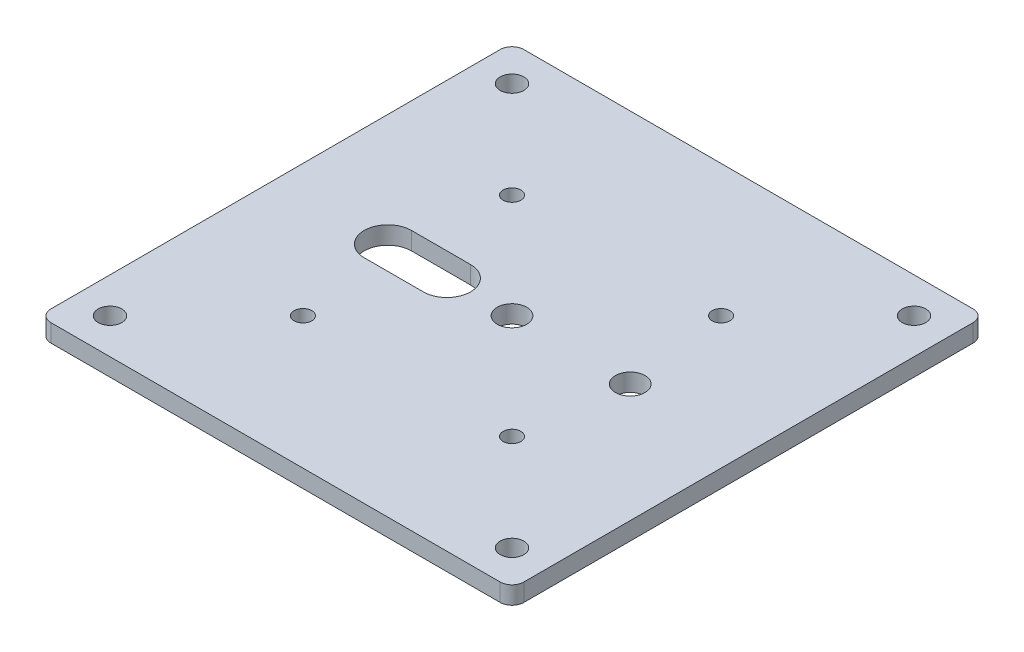
ISO-10303-21;
HEADER;
FILE_DESCRIPTION(('STEP AP214'),'2;1');
FILE_NAME('part.step','',(''),(''),'','','');
FILE_SCHEMA(('AUTOMOTIVE_DESIGN { 1 0 10303 214 1 1 1 1 }'));
ENDSEC;
DATA;
#1=APPLICATION_CONTEXT('core data for automotive mechanical design processes');
#2=APPLICATION_PROTOCOL_DEFINITION('international standard','automotive_design',2000,#1);
#3=PRODUCT_CONTEXT('',#1,'mechanical');
#4=PRODUCT('Part','Part','',(#3));
#5=PRODUCT_RELATED_PRODUCT_CATEGORY('part','',(#4));
#6=PRODUCT_DEFINITION_FORMATION('','',#4);
#7=PRODUCT_DEFINITION_CONTEXT('part definition',#1,'design');
#8=PRODUCT_DEFINITION('design','',#6,#7);
#9=PRODUCT_DEFINITION_SHAPE('','',#8);
#10=(LENGTH_UNIT() NAMED_UNIT(*) SI_UNIT(.MILLI.,.METRE.));
#11=(NAMED_UNIT(*) PLANE_ANGLE_UNIT() SI_UNIT($,.RADIAN.));
#12=(NAMED_UNIT(*) SI_UNIT($,.STERADIAN.) SOLID_ANGLE_UNIT());
#13=UNCERTAINTY_MEASURE_WITH_UNIT(LENGTH_MEASURE(1.E-05),#10,'distance_accuracy_value','');
#14=(GEOMETRIC_REPRESENTATION_CONTEXT(3) GLOBAL_UNCERTAINTY_ASSIGNED_CONTEXT((#13)) GLOBAL_UNIT_ASSIGNED_CONTEXT((#10,
#11,#12)) REPRESENTATION_CONTEXT('',''));
#15=CARTESIAN_POINT('',(0.,0.,0.));
#16=DIRECTION('',(0.,0.,1.));
#17=DIRECTION('',(1.,0.,0.));
#18=AXIS2_PLACEMENT_3D('',#15,#16,#17);
#19=CARTESIAN_POINT('',(0.,3.,-80.));
#20=DIRECTION('',(0.,-1.,0.));
#21=DIRECTION('',(0.,0.,-1.));
#22=AXIS2_PLACEMENT_3D('',#19,#20,#21);
#23=PLANE('',#22);
#24=CARTESIAN_POINT('',(74.,3.,-6.00000000000001));
#25=DIRECTION('',(0.,1.,0.));
#26=DIRECTION('',(0.,0.,1.));
#27=AXIS2_PLACEMENT_3D('',#24,#25,#26);
#28=CIRCLE('',#27,2.00000000000001);
#29=CARTESIAN_POINT('',(74.,3.,-3.99999999999999));
#30=VERTEX_POINT('',#29);
#31=EDGE_CURVE('E402',#30,#30,#28,.T.);
#32=ORIENTED_EDGE('',*,*,#31,.F.);
#33=EDGE_LOOP('',(#32));
#34=FACE_BOUND('',#33,.T.);
#35=CARTESIAN_POINT('',(6.00000000000001,3.,-74.));
#36=DIRECTION('',(0.,1.,0.));
#37=DIRECTION('',(0.,0.,1.));
#38=AXIS2_PLACEMENT_3D('',#35,#36,#37);
#39=CIRCLE('',#38,2.);
#40=CARTESIAN_POINT('',(6.00000000000001,3.,-72.));
#41=VERTEX_POINT('',#40);
#42=EDGE_CURVE('E157',#41,#41,#39,.T.);
#43=ORIENTED_EDGE('',*,*,#42,.F.);
#44=EDGE_LOOP('',(#43));
#45=FACE_BOUND('',#44,.T.);
#46=CARTESIAN_POINT('',(57.6776695296637,3.,-22.3223304703363));
#47=DIRECTION('',(0.,1.,0.));
#48=DIRECTION('',(0.,0.,-1.));
#49=AXIS2_PLACEMENT_3D('',#46,#47,#48);
#50=CIRCLE('',#49,1.5);
#51=CARTESIAN_POINT('',(57.6776695296637,3.,-23.8223304703363));
#52=VERTEX_POINT('',#51);
#53=EDGE_CURVE('E168',#52,#52,#50,.T.);
#54=ORIENTED_EDGE('',*,*,#53,.F.);
#55=EDGE_LOOP('',(#54));
#56=FACE_BOUND('',#55,.T.);
#57=CARTESIAN_POINT('',(22.3223304703363,3.,-22.3223304703363));
#58=DIRECTION('',(0.,1.,0.));
#59=DIRECTION('',(0.,0.,-1.));
#60=AXIS2_PLACEMENT_3D('',#57,#58,#59);
#61=CIRCLE('',#60,1.5);
#62=CARTESIAN_POINT('',(22.3223304703363,3.,-23.8223304703363));
#63=VERTEX_POINT('',#62);
#64=EDGE_CURVE('E180',#63,#63,#61,.T.);
#65=ORIENTED_EDGE('',*,*,#64,.F.);
#66=EDGE_LOOP('',(#65));
#67=FACE_BOUND('',#66,.T.);
#68=CARTESIAN_POINT('',(60.,3.,-40.));
#69=DIRECTION('',(0.,1.,0.));
#70=DIRECTION('',(0.,0.,1.));
#71=AXIS2_PLACEMENT_3D('',#68,#69,#70);
#72=CIRCLE('',#71,2.5);
#73=CARTESIAN_POINT('',(60.,3.,-37.5));
#74=VERTEX_POINT('',#73);
#75=EDGE_CURVE('E192',#74,#74,#72,.T.);
#76=ORIENTED_EDGE('',*,*,#75,.F.);
#77=EDGE_LOOP('',(#76));
#78=FACE_BOUND('',#77,.T.);
#79=DIRECTION('',(0.,0.,-1.));
#80=VECTOR('',#79,1.);
#81=CARTESIAN_POINT('',(80.,3.,0.));
#82=LINE('',#81,#80);
#83=CARTESIAN_POINT('',(80.,3.,-2.));
#84=VERTEX_POINT('',#83);
#85=CARTESIAN_POINT('',(80.,3.,-78.));
#86=VERTEX_POINT('',#85);
#87=EDGE_CURVE('E209',#84,#86,#82,.T.);
#88=ORIENTED_EDGE('',*,*,#87,.T.);
#89=CARTESIAN_POINT('',(78.,3.,-78.));
#90=DIRECTION('',(0.,-1.,0.));
#91=DIRECTION('',(0.,0.,-1.));
#92=AXIS2_PLACEMENT_3D('',#89,#90,#91);
#93=CIRCLE('',#92,2.);
#94=CARTESIAN_POINT('',(78.,3.,-80.));
#95=VERTEX_POINT('',#94);
#96=EDGE_CURVE('E247',#86,#95,#93,.F.);
#97=ORIENTED_EDGE('',*,*,#96,.T.);
#98=DIRECTION('',(-1.,0.,0.));
#99=VECTOR('',#98,1.);
#100=CARTESIAN_POINT('',(0.,3.,-80.));
#101=LINE('',#100,#99);
#102=CARTESIAN_POINT('',(2.,3.,-80.));
#103=VERTEX_POINT('',#102);
#104=EDGE_CURVE('E212',#95,#103,#101,.T.);
#105=ORIENTED_EDGE('',*,*,#104,.T.);
#106=CARTESIAN_POINT('',(2.,3.,-78.));
#107=DIRECTION('',(0.,-1.,0.));
#108=DIRECTION('',(0.,0.,-1.));
#109=AXIS2_PLACEMENT_3D('',#106,#107,#108);
#110=CIRCLE('',#109,2.);
#111=CARTESIAN_POINT('',(0.,3.,-78.));
#112=VERTEX_POINT('',#111);
#113=EDGE_CURVE('E243',#103,#112,#110,.F.);
#114=ORIENTED_EDGE('',*,*,#113,.T.);
#115=DIRECTION('',(0.,0.,1.));
#116=VECTOR('',#115,1.);
#117=CARTESIAN_POINT('',(0.,3.,0.));
#118=LINE('',#117,#116);
#119=CARTESIAN_POINT('',(0.,3.,-2.));
#120=VERTEX_POINT('',#119);
#121=EDGE_CURVE('E204',#112,#120,#118,.T.);
#122=ORIENTED_EDGE('',*,*,#121,.T.);
#123=CARTESIAN_POINT('',(2.,3.,-2.));
#124=DIRECTION('',(0.,-1.,0.));
#125=DIRECTION('',(0.,0.,-1.));
#126=AXIS2_PLACEMENT_3D('',#123,#124,#125);
#127=CIRCLE('',#126,2.);
#128=CARTESIAN_POINT('',(2.,3.,0.));
#129=VERTEX_POINT('',#128);
#130=EDGE_CURVE('E53',#120,#129,#127,.F.);
#131=ORIENTED_EDGE('',*,*,#130,.T.);
#132=DIRECTION('',(1.,0.,0.));
#133=VECTOR('',#132,1.);
#134=CARTESIAN_POINT('',(0.,3.,0.));
#135=LINE('',#134,#133);
#136=CARTESIAN_POINT('',(78.,3.,0.));
#137=VERTEX_POINT('',#136);
#138=EDGE_CURVE('E206',#129,#137,#135,.T.);
#139=ORIENTED_EDGE('',*,*,#138,.T.);
#140=CARTESIAN_POINT('',(78.,3.,-2.));
#141=DIRECTION('',(0.,-1.,0.));
#142=DIRECTION('',(0.,0.,-1.));
#143=AXIS2_PLACEMENT_3D('',#140,#141,#142);
#144=CIRCLE('',#143,2.);
#145=EDGE_CURVE('E245',#137,#84,#144,.F.);
#146=ORIENTED_EDGE('',*,*,#145,.T.);
#147=EDGE_LOOP('',(#88,#97,#105,#114,#122,#131,#139,#146));
#148=FACE_BOUND('',#147,.T.);
#149=CARTESIAN_POINT('',(40.,3.,-40.));
#150=DIRECTION('',(0.,1.,0.));
#151=DIRECTION('',(0.,0.,1.));
#152=AXIS2_PLACEMENT_3D('',#149,#150,#151);
#153=CIRCLE('',#152,2.5);
#154=CARTESIAN_POINT('',(40.,3.,-37.5));
#155=VERTEX_POINT('',#154);
#156=EDGE_CURVE('E198',#155,#155,#153,.T.);
#157=ORIENTED_EDGE('',*,*,#156,.F.);
#158=EDGE_LOOP('',(#157));
#159=FACE_BOUND('',#158,.T.);
#160=CARTESIAN_POINT('',(57.6776695296637,3.,-57.6776695296637));
#161=DIRECTION('',(0.,1.,0.));
#162=DIRECTION('',(0.,0.,1.));
#163=AXIS2_PLACEMENT_3D('',#160,#161,#162);
#164=CIRCLE('',#163,1.5);
#165=CARTESIAN_POINT('',(57.6776695296637,3.,-56.1776695296637));
#166=VERTEX_POINT('',#165);
#167=EDGE_CURVE('E186',#166,#166,#164,.T.);
#168=ORIENTED_EDGE('',*,*,#167,.F.);
#169=EDGE_LOOP('',(#168));
#170=FACE_BOUND('',#169,.T.);
#171=CARTESIAN_POINT('',(22.3223304703363,3.,-57.6776695296637));
#172=DIRECTION('',(0.,1.,0.));
#173=DIRECTION('',(0.,0.,1.));
#174=AXIS2_PLACEMENT_3D('',#171,#172,#173);
#175=CIRCLE('',#174,1.5);
#176=CARTESIAN_POINT('',(22.3223304703363,3.,-56.1776695296637));
#177=VERTEX_POINT('',#176);
#178=EDGE_CURVE('E174',#177,#177,#175,.T.);
#179=ORIENTED_EDGE('',*,*,#178,.F.);
#180=EDGE_LOOP('',(#179));
#181=FACE_BOUND('',#180,.T.);
#182=CARTESIAN_POINT('',(19.,3.,-40.));
#183=DIRECTION('',(0.,1.,0.));
#184=DIRECTION('',(0.,0.,1.));
#185=AXIS2_PLACEMENT_3D('',#182,#183,#184);
#186=CIRCLE('',#185,4.);
#187=CARTESIAN_POINT('',(19.,3.,-44.));
#188=VERTEX_POINT('',#187);
#189=CARTESIAN_POINT('',(19.,3.,-36.));
#190=VERTEX_POINT('',#189);
#191=EDGE_CURVE('E122',#188,#190,#186,.T.);
#192=ORIENTED_EDGE('',*,*,#191,.F.);
#193=DIRECTION('',(-1.,0.,0.));
#194=VECTOR('',#193,1.);
#195=CARTESIAN_POINT('',(19.,3.,-44.));
#196=LINE('',#195,#194);
#197=CARTESIAN_POINT('',(29.,3.,-44.));
#198=VERTEX_POINT('',#197);
#199=EDGE_CURVE('E150',#198,#188,#196,.T.);
#200=ORIENTED_EDGE('',*,*,#199,.F.);
#201=CARTESIAN_POINT('',(29.,3.,-40.));
#202=DIRECTION('',(0.,1.,0.));
#203=DIRECTION('',(0.,0.,1.));
#204=AXIS2_PLACEMENT_3D('',#201,#202,#203);
#205=CIRCLE('',#204,4.);
#206=CARTESIAN_POINT('',(29.,3.,-36.));
#207=VERTEX_POINT('',#206);
#208=EDGE_CURVE('E148',#207,#198,#205,.T.);
#209=ORIENTED_EDGE('',*,*,#208,.F.);
#210=DIRECTION('',(1.,0.,0.));
#211=VECTOR('',#210,1.);
#212=CARTESIAN_POINT('',(19.,3.,-36.));
#213=LINE('',#212,#211);
#214=EDGE_CURVE('E132',#190,#207,#213,.T.);
#215=ORIENTED_EDGE('',*,*,#214,.F.);
#216=EDGE_LOOP('',(#192,#200,#209,#215));
#217=FACE_BOUND('',#216,.T.);
#218=CARTESIAN_POINT('',(74.,3.,-74.));
#219=DIRECTION('',(0.,1.,0.));
#220=DIRECTION('',(0.,0.,-1.));
#221=AXIS2_PLACEMENT_3D('',#218,#219,#220);
#222=CIRCLE('',#221,2.00000000000001);
#223=CARTESIAN_POINT('',(74.,3.,-76.));
#224=VERTEX_POINT('',#223);
#225=EDGE_CURVE('E407',#224,#224,#222,.T.);
#226=ORIENTED_EDGE('',*,*,#225,.F.);
#227=EDGE_LOOP('',(#226));
#228=FACE_BOUND('',#227,.T.);
#229=CARTESIAN_POINT('',(6.00000000000001,3.,-6.00000000000001));
#230=DIRECTION('',(0.,1.,0.));
#231=DIRECTION('',(0.,0.,-1.));
#232=AXIS2_PLACEMENT_3D('',#229,#230,#231);
#233=CIRCLE('',#232,2.);
#234=CARTESIAN_POINT('',(6.00000000000001,3.,-8.00000000000001));
#235=VERTEX_POINT('',#234);
#236=EDGE_CURVE('E397',#235,#235,#233,.T.);
#237=ORIENTED_EDGE('',*,*,#236,.F.);
#238=EDGE_LOOP('',(#237));
#239=FACE_BOUND('',#238,.T.);
#240=ADVANCED_FACE('F31',(#34,#45,#56,#67,#78,#148,#159,#170,#181,#217,#228,#239),#23,.F.);
#241=CARTESIAN_POINT('',(0.,0.,-80.));
#242=DIRECTION('',(0.,-1.,0.));
#243=DIRECTION('',(0.,0.,-1.));
#244=AXIS2_PLACEMENT_3D('',#241,#242,#243);
#245=PLANE('',#244);
#246=CARTESIAN_POINT('',(74.,0.,-6.00000000000001));
#247=DIRECTION('',(0.,1.,0.));
#248=DIRECTION('',(0.,0.,1.));
#249=AXIS2_PLACEMENT_3D('',#246,#247,#248);
#250=CIRCLE('',#249,2.00000000000001);
#251=CARTESIAN_POINT('',(74.,0.,-3.99999999999999));
#252=VERTEX_POINT('',#251);
#253=EDGE_CURVE('E399',#252,#252,#250,.T.);
#254=ORIENTED_EDGE('',*,*,#253,.T.);
#255=EDGE_LOOP('',(#254));
#256=FACE_BOUND('',#255,.T.);
#257=CARTESIAN_POINT('',(6.00000000000001,0.,-74.));
#258=DIRECTION('',(0.,1.,0.));
#259=DIRECTION('',(0.,0.,1.));
#260=AXIS2_PLACEMENT_3D('',#257,#258,#259);
#261=CIRCLE('',#260,2.);
#262=CARTESIAN_POINT('',(6.00000000000001,0.,-72.));
#263=VERTEX_POINT('',#262);
#264=EDGE_CURVE('E410',#263,#263,#261,.T.);
#265=ORIENTED_EDGE('',*,*,#264,.T.);
#266=EDGE_LOOP('',(#265));
#267=FACE_BOUND('',#266,.T.);
#268=CARTESIAN_POINT('',(57.6776695296637,0.,-22.3223304703363));
#269=DIRECTION('',(0.,1.,0.));
#270=DIRECTION('',(0.,0.,-1.));
#271=AXIS2_PLACEMENT_3D('',#268,#269,#270);
#272=CIRCLE('',#271,1.5);
#273=CARTESIAN_POINT('',(57.6776695296637,0.,-23.8223304703363));
#274=VERTEX_POINT('',#273);
#275=EDGE_CURVE('E142',#274,#274,#272,.T.);
#276=ORIENTED_EDGE('',*,*,#275,.T.);
#277=EDGE_LOOP('',(#276));
#278=FACE_BOUND('',#277,.T.);
#279=CARTESIAN_POINT('',(22.3223304703363,0.,-22.3223304703363));
#280=DIRECTION('',(0.,1.,0.));
#281=DIRECTION('',(0.,0.,-1.));
#282=AXIS2_PLACEMENT_3D('',#279,#280,#281);
#283=CIRCLE('',#282,1.5);
#284=CARTESIAN_POINT('',(22.3223304703363,0.,-23.8223304703363));
#285=VERTEX_POINT('',#284);
#286=EDGE_CURVE('E177',#285,#285,#283,.T.);
#287=ORIENTED_EDGE('',*,*,#286,.T.);
#288=EDGE_LOOP('',(#287));
#289=FACE_BOUND('',#288,.T.);
#290=CARTESIAN_POINT('',(60.,0.,-40.));
#291=DIRECTION('',(0.,1.,0.));
#292=DIRECTION('',(0.,0.,1.));
#293=AXIS2_PLACEMENT_3D('',#290,#291,#292);
#294=CIRCLE('',#293,2.5);
#295=CARTESIAN_POINT('',(60.,0.,-37.5));
#296=VERTEX_POINT('',#295);
#297=EDGE_CURVE('E189',#296,#296,#294,.T.);
#298=ORIENTED_EDGE('',*,*,#297,.T.);
#299=EDGE_LOOP('',(#298));
#300=FACE_BOUND('',#299,.T.);
#301=DIRECTION('',(-1.,0.,0.));
#302=VECTOR('',#301,1.);
#303=CARTESIAN_POINT('',(0.,0.,-80.));
#304=LINE('',#303,#302);
#305=CARTESIAN_POINT('',(78.,0.,-80.));
#306=VERTEX_POINT('',#305);
#307=CARTESIAN_POINT('',(2.,0.,-80.));
#308=VERTEX_POINT('',#307);
#309=EDGE_CURVE('E207',#306,#308,#304,.T.);
#310=ORIENTED_EDGE('',*,*,#309,.F.);
#311=CARTESIAN_POINT('',(78.,0.,-78.));
#312=DIRECTION('',(0.,-1.,0.));
#313=DIRECTION('',(0.,0.,-1.));
#314=AXIS2_PLACEMENT_3D('',#311,#312,#313);
#315=CIRCLE('',#314,2.);
#316=CARTESIAN_POINT('',(80.,0.,-78.));
#317=VERTEX_POINT('',#316);
#318=EDGE_CURVE('E235',#306,#317,#315,.T.);
#319=ORIENTED_EDGE('',*,*,#318,.T.);
#320=DIRECTION('',(0.,0.,-1.));
#321=VECTOR('',#320,1.);
#322=CARTESIAN_POINT('',(80.,0.,0.));
#323=LINE('',#322,#321);
#324=CARTESIAN_POINT('',(80.,0.,-2.));
#325=VERTEX_POINT('',#324);
#326=EDGE_CURVE('E220',#325,#317,#323,.T.);
#327=ORIENTED_EDGE('',*,*,#326,.F.);
#328=CARTESIAN_POINT('',(78.,0.,-2.));
#329=DIRECTION('',(0.,-1.,0.));
#330=DIRECTION('',(0.,0.,-1.));
#331=AXIS2_PLACEMENT_3D('',#328,#329,#330);
#332=CIRCLE('',#331,2.);
#333=CARTESIAN_POINT('',(78.,0.,0.));
#334=VERTEX_POINT('',#333);
#335=EDGE_CURVE('E233',#325,#334,#332,.T.);
#336=ORIENTED_EDGE('',*,*,#335,.T.);
#337=DIRECTION('',(1.,0.,0.));
#338=VECTOR('',#337,1.);
#339=CARTESIAN_POINT('',(0.,0.,0.));
#340=LINE('',#339,#338);
#341=CARTESIAN_POINT('',(2.,0.,0.));
#342=VERTEX_POINT('',#341);
#343=EDGE_CURVE('E218',#342,#334,#340,.T.);
#344=ORIENTED_EDGE('',*,*,#343,.F.);
#345=CARTESIAN_POINT('',(2.,0.,-2.));
#346=DIRECTION('',(0.,-1.,0.));
#347=DIRECTION('',(0.,0.,-1.));
#348=AXIS2_PLACEMENT_3D('',#345,#346,#347);
#349=CIRCLE('',#348,2.);
#350=CARTESIAN_POINT('',(0.,0.,-2.));
#351=VERTEX_POINT('',#350);
#352=EDGE_CURVE('E229',#342,#351,#349,.T.);
#353=ORIENTED_EDGE('',*,*,#352,.T.);
#354=DIRECTION('',(0.,0.,1.));
#355=VECTOR('',#354,1.);
#356=CARTESIAN_POINT('',(0.,0.,0.));
#357=LINE('',#356,#355);
#358=CARTESIAN_POINT('',(0.,0.,-78.));
#359=VERTEX_POINT('',#358);
#360=EDGE_CURVE('E201',#359,#351,#357,.T.);
#361=ORIENTED_EDGE('',*,*,#360,.F.);
#362=CARTESIAN_POINT('',(2.,0.,-78.));
#363=DIRECTION('',(0.,-1.,0.));
#364=DIRECTION('',(0.,0.,-1.));
#365=AXIS2_PLACEMENT_3D('',#362,#363,#364);
#366=CIRCLE('',#365,2.);
#367=EDGE_CURVE('E231',#359,#308,#366,.T.);
#368=ORIENTED_EDGE('',*,*,#367,.T.);
#369=EDGE_LOOP('',(#310,#319,#327,#336,#344,#353,#361,#368));
#370=FACE_BOUND('',#369,.T.);
#371=CARTESIAN_POINT('',(40.,0.,-40.));
#372=DIRECTION('',(0.,1.,0.));
#373=DIRECTION('',(0.,0.,1.));
#374=AXIS2_PLACEMENT_3D('',#371,#372,#373);
#375=CIRCLE('',#374,2.5);
#376=CARTESIAN_POINT('',(40.,0.,-37.5));
#377=VERTEX_POINT('',#376);
#378=EDGE_CURVE('E195',#377,#377,#375,.T.);
#379=ORIENTED_EDGE('',*,*,#378,.T.);
#380=EDGE_LOOP('',(#379));
#381=FACE_BOUND('',#380,.T.);
#382=CARTESIAN_POINT('',(57.6776695296637,0.,-57.6776695296637));
#383=DIRECTION('',(0.,1.,0.));
#384=DIRECTION('',(0.,0.,1.));
#385=AXIS2_PLACEMENT_3D('',#382,#383,#384);
#386=CIRCLE('',#385,1.5);
#387=CARTESIAN_POINT('',(57.6776695296637,0.,-56.1776695296637));
#388=VERTEX_POINT('',#387);
#389=EDGE_CURVE('E183',#388,#388,#386,.T.);
#390=ORIENTED_EDGE('',*,*,#389,.T.);
#391=EDGE_LOOP('',(#390));
#392=FACE_BOUND('',#391,.T.);
#393=CARTESIAN_POINT('',(22.3223304703363,0.,-57.6776695296637));
#394=DIRECTION('',(0.,1.,0.));
#395=DIRECTION('',(0.,0.,1.));
#396=AXIS2_PLACEMENT_3D('',#393,#394,#395);
#397=CIRCLE('',#396,1.5);
#398=CARTESIAN_POINT('',(22.3223304703363,0.,-56.1776695296637));
#399=VERTEX_POINT('',#398);
#400=EDGE_CURVE('E171',#399,#399,#397,.T.);
#401=ORIENTED_EDGE('',*,*,#400,.T.);
#402=EDGE_LOOP('',(#401));
#403=FACE_BOUND('',#402,.T.);
#404=DIRECTION('',(-1.,0.,0.));
#405=VECTOR('',#404,1.);
#406=CARTESIAN_POINT('',(19.,0.,-44.));
#407=LINE('',#406,#405);
#408=CARTESIAN_POINT('',(29.,0.,-44.));
#409=VERTEX_POINT('',#408);
#410=CARTESIAN_POINT('',(19.,0.,-44.));
#411=VERTEX_POINT('',#410);
#412=EDGE_CURVE('E133',#409,#411,#407,.T.);
#413=ORIENTED_EDGE('',*,*,#412,.T.);
#414=CARTESIAN_POINT('',(19.,0.,-40.));
#415=DIRECTION('',(0.,1.,0.));
#416=DIRECTION('',(0.,0.,-1.));
#417=AXIS2_PLACEMENT_3D('',#414,#415,#416);
#418=CIRCLE('',#417,4.);
#419=CARTESIAN_POINT('',(19.,0.,-36.));
#420=VERTEX_POINT('',#419);
#421=EDGE_CURVE('E155',#411,#420,#418,.T.);
#422=ORIENTED_EDGE('',*,*,#421,.T.);
#423=DIRECTION('',(1.,0.,0.));
#424=VECTOR('',#423,1.);
#425=CARTESIAN_POINT('',(19.,0.,-36.));
#426=LINE('',#425,#424);
#427=CARTESIAN_POINT('',(29.,0.,-36.));
#428=VERTEX_POINT('',#427);
#429=EDGE_CURVE('E140',#420,#428,#426,.T.);
#430=ORIENTED_EDGE('',*,*,#429,.T.);
#431=CARTESIAN_POINT('',(29.,0.,-40.));
#432=DIRECTION('',(0.,1.,0.));
#433=DIRECTION('',(0.,0.,-1.));
#434=AXIS2_PLACEMENT_3D('',#431,#432,#433);
#435=CIRCLE('',#434,4.);
#436=EDGE_CURVE('E159',#428,#409,#435,.T.);
#437=ORIENTED_EDGE('',*,*,#436,.T.);
#438=EDGE_LOOP('',(#413,#422,#430,#437));
#439=FACE_BOUND('',#438,.T.);
#440=CARTESIAN_POINT('',(74.,0.,-74.));
#441=DIRECTION('',(0.,1.,0.));
#442=DIRECTION('',(0.,0.,-1.));
#443=AXIS2_PLACEMENT_3D('',#440,#441,#442);
#444=CIRCLE('',#443,2.00000000000001);
#445=CARTESIAN_POINT('',(74.,0.,-76.));
#446=VERTEX_POINT('',#445);
#447=EDGE_CURVE('E393',#446,#446,#444,.T.);
#448=ORIENTED_EDGE('',*,*,#447,.T.);
#449=EDGE_LOOP('',(#448));
#450=FACE_BOUND('',#449,.T.);
#451=CARTESIAN_POINT('',(6.00000000000001,0.,-6.00000000000001));
#452=DIRECTION('',(0.,1.,0.));
#453=DIRECTION('',(0.,0.,-1.));
#454=AXIS2_PLACEMENT_3D('',#451,#452,#453);
#455=CIRCLE('',#454,2.);
#456=CARTESIAN_POINT('',(6.00000000000001,0.,-8.00000000000001));
#457=VERTEX_POINT('',#456);
#458=EDGE_CURVE('E396',#457,#457,#455,.T.);
#459=ORIENTED_EDGE('',*,*,#458,.T.);
#460=EDGE_LOOP('',(#459));
#461=FACE_BOUND('',#460,.T.);
#462=ADVANCED_FACE('F266',(#256,#267,#278,#289,#300,#370,#381,#392,#403,#439,#450,#461),#245,.T.);
#463=CARTESIAN_POINT('',(0.,3.,0.));
#464=DIRECTION('',(1.,0.,0.));
#465=DIRECTION('',(0.,0.,-1.));
#466=AXIS2_PLACEMENT_3D('',#463,#464,#465);
#467=PLANE('',#466);
#468=ORIENTED_EDGE('',*,*,#121,.F.);
#469=DIRECTION('',(0.,-1.,0.));
#470=VECTOR('',#469,1.);
#471=CARTESIAN_POINT('',(0.,3.,-78.));
#472=LINE('',#471,#470);
#473=EDGE_CURVE('E11',#112,#359,#472,.T.);
#474=ORIENTED_EDGE('',*,*,#473,.T.);
#475=ORIENTED_EDGE('',*,*,#360,.T.);
#476=DIRECTION('',(0.,-1.,0.));
#477=VECTOR('',#476,1.);
#478=CARTESIAN_POINT('',(0.,3.,-2.));
#479=LINE('',#478,#477);
#480=EDGE_CURVE('E39',#351,#120,#479,.F.);
#481=ORIENTED_EDGE('',*,*,#480,.T.);
#482=EDGE_LOOP('',(#468,#474,#475,#481));
#483=FACE_BOUND('',#482,.T.);
#484=ADVANCED_FACE('F255',(#483),#467,.F.);
#485=CARTESIAN_POINT('',(0.,3.,0.));
#486=DIRECTION('',(0.,0.,-1.));
#487=DIRECTION('',(-1.,0.,0.));
#488=AXIS2_PLACEMENT_3D('',#485,#486,#487);
#489=PLANE('',#488);
#490=ORIENTED_EDGE('',*,*,#343,.T.);
#491=DIRECTION('',(0.,-1.,0.));
#492=VECTOR('',#491,1.);
#493=CARTESIAN_POINT('',(78.,3.,0.));
#494=LINE('',#493,#492);
#495=EDGE_CURVE('E46',#334,#137,#494,.F.);
#496=ORIENTED_EDGE('',*,*,#495,.T.);
#497=ORIENTED_EDGE('',*,*,#138,.F.);
#498=DIRECTION('',(0.,-1.,0.));
#499=VECTOR('',#498,1.);
#500=CARTESIAN_POINT('',(2.,3.,0.));
#501=LINE('',#500,#499);
#502=EDGE_CURVE('E249',#129,#342,#501,.T.);
#503=ORIENTED_EDGE('',*,*,#502,.T.);
#504=EDGE_LOOP('',(#490,#496,#497,#503));
#505=FACE_BOUND('',#504,.T.);
#506=ADVANCED_FACE('F263',(#505),#489,.F.);
#507=CARTESIAN_POINT('',(80.,3.,0.));
#508=DIRECTION('',(-1.,0.,0.));
#509=DIRECTION('',(0.,0.,1.));
#510=AXIS2_PLACEMENT_3D('',#507,#508,#509);
#511=PLANE('',#510);
#512=ORIENTED_EDGE('',*,*,#326,.T.);
#513=DIRECTION('',(0.,-1.,0.));
#514=VECTOR('',#513,1.);
#515=CARTESIAN_POINT('',(80.,3.,-78.));
#516=LINE('',#515,#514);
#517=EDGE_CURVE('E240',#317,#86,#516,.F.);
#518=ORIENTED_EDGE('',*,*,#517,.T.);
#519=ORIENTED_EDGE('',*,*,#87,.F.);
#520=DIRECTION('',(0.,-1.,0.));
#521=VECTOR('',#520,1.);
#522=CARTESIAN_POINT('',(80.,3.,-2.));
#523=LINE('',#522,#521);
#524=EDGE_CURVE('E237',#84,#325,#523,.T.);
#525=ORIENTED_EDGE('',*,*,#524,.T.);
#526=EDGE_LOOP('',(#512,#518,#519,#525));
#527=FACE_BOUND('',#526,.T.);
#528=ADVANCED_FACE('F275',(#527),#511,.F.);
#529=CARTESIAN_POINT('',(0.,3.,-80.));
#530=DIRECTION('',(0.,0.,1.));
#531=DIRECTION('',(1.,0.,0.));
#532=AXIS2_PLACEMENT_3D('',#529,#530,#531);
#533=PLANE('',#532);
#534=ORIENTED_EDGE('',*,*,#104,.F.);
#535=DIRECTION('',(0.,-1.,0.));
#536=VECTOR('',#535,1.);
#537=CARTESIAN_POINT('',(78.,3.,-80.));
#538=LINE('',#537,#536);
#539=EDGE_CURVE('E226',#95,#306,#538,.T.);
#540=ORIENTED_EDGE('',*,*,#539,.T.);
#541=ORIENTED_EDGE('',*,*,#309,.T.);
#542=DIRECTION('',(0.,-1.,0.));
#543=VECTOR('',#542,1.);
#544=CARTESIAN_POINT('',(2.,3.,-80.));
#545=LINE('',#544,#543);
#546=EDGE_CURVE('E215',#308,#103,#545,.F.);
#547=ORIENTED_EDGE('',*,*,#546,.T.);
#548=EDGE_LOOP('',(#534,#540,#541,#547));
#549=FACE_BOUND('',#548,.T.);
#550=ADVANCED_FACE('F283',(#549),#533,.F.);
#551=CARTESIAN_POINT('',(40.,3.,-40.));
#552=DIRECTION('',(0.,-1.,0.));
#553=DIRECTION('',(0.,0.,-1.));
#554=AXIS2_PLACEMENT_3D('',#551,#552,#553);
#555=CYLINDRICAL_SURFACE('',#554,2.5);
#556=ORIENTED_EDGE('',*,*,#156,.T.);
#557=EDGE_LOOP('',(#556));
#558=FACE_BOUND('',#557,.T.);
#559=ORIENTED_EDGE('',*,*,#378,.F.);
#560=EDGE_LOOP('',(#559));
#561=FACE_BOUND('',#560,.T.);
#562=ADVANCED_FACE('F304',(#558,#561),#555,.F.);
#563=CARTESIAN_POINT('',(60.,3.,-40.));
#564=DIRECTION('',(0.,-1.,0.));
#565=DIRECTION('',(0.,0.,-1.));
#566=AXIS2_PLACEMENT_3D('',#563,#564,#565);
#567=CYLINDRICAL_SURFACE('',#566,2.5);
#568=ORIENTED_EDGE('',*,*,#75,.T.);
#569=EDGE_LOOP('',(#568));
#570=FACE_BOUND('',#569,.T.);
#571=ORIENTED_EDGE('',*,*,#297,.F.);
#572=EDGE_LOOP('',(#571));
#573=FACE_BOUND('',#572,.T.);
#574=ADVANCED_FACE('F365',(#570,#573),#567,.F.);
#575=CARTESIAN_POINT('',(57.6776695296637,3.,-57.6776695296637));
#576=DIRECTION('',(0.,-1.,0.));
#577=DIRECTION('',(0.,0.,-1.));
#578=AXIS2_PLACEMENT_3D('',#575,#576,#577);
#579=CYLINDRICAL_SURFACE('',#578,1.5);
#580=ORIENTED_EDGE('',*,*,#167,.T.);
#581=EDGE_LOOP('',(#580));
#582=FACE_BOUND('',#581,.T.);
#583=ORIENTED_EDGE('',*,*,#389,.F.);
#584=EDGE_LOOP('',(#583));
#585=FACE_BOUND('',#584,.T.);
#586=ADVANCED_FACE('F362',(#582,#585),#579,.F.);
#587=CARTESIAN_POINT('',(22.3223304703363,3.,-22.3223304703363));
#588=DIRECTION('',(0.,-1.,0.));
#589=DIRECTION('',(0.,0.,-1.));
#590=AXIS2_PLACEMENT_3D('',#587,#588,#589);
#591=CYLINDRICAL_SURFACE('',#590,1.5);
#592=ORIENTED_EDGE('',*,*,#64,.T.);
#593=EDGE_LOOP('',(#592));
#594=FACE_BOUND('',#593,.T.);
#595=ORIENTED_EDGE('',*,*,#286,.F.);
#596=EDGE_LOOP('',(#595));
#597=FACE_BOUND('',#596,.T.);
#598=ADVANCED_FACE('F358',(#594,#597),#591,.F.);
#599=CARTESIAN_POINT('',(22.3223304703363,3.,-57.6776695296637));
#600=DIRECTION('',(0.,-1.,0.));
#601=DIRECTION('',(0.,0.,-1.));
#602=AXIS2_PLACEMENT_3D('',#599,#600,#601);
#603=CYLINDRICAL_SURFACE('',#602,1.5);
#604=ORIENTED_EDGE('',*,*,#178,.T.);
#605=EDGE_LOOP('',(#604));
#606=FACE_BOUND('',#605,.T.);
#607=ORIENTED_EDGE('',*,*,#400,.F.);
#608=EDGE_LOOP('',(#607));
#609=FACE_BOUND('',#608,.T.);
#610=ADVANCED_FACE('F354',(#606,#609),#603,.F.);
#611=CARTESIAN_POINT('',(57.6776695296637,3.,-22.3223304703363));
#612=DIRECTION('',(0.,-1.,0.));
#613=DIRECTION('',(0.,0.,-1.));
#614=AXIS2_PLACEMENT_3D('',#611,#612,#613);
#615=CYLINDRICAL_SURFACE('',#614,1.5);
#616=ORIENTED_EDGE('',*,*,#53,.T.);
#617=EDGE_LOOP('',(#616));
#618=FACE_BOUND('',#617,.T.);
#619=ORIENTED_EDGE('',*,*,#275,.F.);
#620=EDGE_LOOP('',(#619));
#621=FACE_BOUND('',#620,.T.);
#622=ADVANCED_FACE('F351',(#618,#621),#615,.F.);
#623=CARTESIAN_POINT('',(19.,3.,-40.));
#624=DIRECTION('',(0.,-1.,0.));
#625=DIRECTION('',(0.,0.,-1.));
#626=AXIS2_PLACEMENT_3D('',#623,#624,#625);
#627=CYLINDRICAL_SURFACE('',#626,4.);
#628=ORIENTED_EDGE('',*,*,#421,.F.);
#629=DIRECTION('',(0.,-1.,0.));
#630=VECTOR('',#629,1.);
#631=CARTESIAN_POINT('',(19.,3.,-44.));
#632=LINE('',#631,#630);
#633=EDGE_CURVE('E128',#188,#411,#632,.T.);
#634=ORIENTED_EDGE('',*,*,#633,.F.);
#635=ORIENTED_EDGE('',*,*,#191,.T.);
#636=DIRECTION('',(0.,-1.,0.));
#637=VECTOR('',#636,1.);
#638=CARTESIAN_POINT('',(19.,3.,-36.));
#639=LINE('',#638,#637);
#640=EDGE_CURVE('E126',#190,#420,#639,.T.);
#641=ORIENTED_EDGE('',*,*,#640,.T.);
#642=EDGE_LOOP('',(#628,#634,#635,#641));
#643=FACE_BOUND('',#642,.T.);
#644=ADVANCED_FACE('F125',(#643),#627,.F.);
#645=CARTESIAN_POINT('',(19.,3.,-36.));
#646=DIRECTION('',(0.,0.,-1.));
#647=DIRECTION('',(-1.,0.,0.));
#648=AXIS2_PLACEMENT_3D('',#645,#646,#647);
#649=PLANE('',#648);
#650=ORIENTED_EDGE('',*,*,#429,.F.);
#651=ORIENTED_EDGE('',*,*,#640,.F.);
#652=ORIENTED_EDGE('',*,*,#214,.T.);
#653=DIRECTION('',(0.,-1.,0.));
#654=VECTOR('',#653,1.);
#655=CARTESIAN_POINT('',(29.,3.,-36.));
#656=LINE('',#655,#654);
#657=EDGE_CURVE('E143',#207,#428,#656,.T.);
#658=ORIENTED_EDGE('',*,*,#657,.T.);
#659=EDGE_LOOP('',(#650,#651,#652,#658));
#660=FACE_BOUND('',#659,.T.);
#661=ADVANCED_FACE('F136',(#660),#649,.T.);
#662=CARTESIAN_POINT('',(29.,3.,-40.));
#663=DIRECTION('',(0.,-1.,0.));
#664=DIRECTION('',(0.,0.,-1.));
#665=AXIS2_PLACEMENT_3D('',#662,#663,#664);
#666=CYLINDRICAL_SURFACE('',#665,4.);
#667=ORIENTED_EDGE('',*,*,#436,.F.);
#668=ORIENTED_EDGE('',*,*,#657,.F.);
#669=ORIENTED_EDGE('',*,*,#208,.T.);
#670=DIRECTION('',(0.,-1.,0.));
#671=VECTOR('',#670,1.);
#672=CARTESIAN_POINT('',(29.,3.,-44.));
#673=LINE('',#672,#671);
#674=EDGE_CURVE('E165',#198,#409,#673,.T.);
#675=ORIENTED_EDGE('',*,*,#674,.T.);
#676=EDGE_LOOP('',(#667,#668,#669,#675));
#677=FACE_BOUND('',#676,.T.);
#678=ADVANCED_FACE('F342',(#677),#666,.F.);
#679=CARTESIAN_POINT('',(19.,3.,-44.));
#680=DIRECTION('',(0.,0.,1.));
#681=DIRECTION('',(1.,0.,0.));
#682=AXIS2_PLACEMENT_3D('',#679,#680,#681);
#683=PLANE('',#682);
#684=ORIENTED_EDGE('',*,*,#412,.F.);
#685=ORIENTED_EDGE('',*,*,#674,.F.);
#686=ORIENTED_EDGE('',*,*,#199,.T.);
#687=ORIENTED_EDGE('',*,*,#633,.T.);
#688=EDGE_LOOP('',(#684,#685,#686,#687));
#689=FACE_BOUND('',#688,.T.);
#690=ADVANCED_FACE('F338',(#689),#683,.T.);
#691=CARTESIAN_POINT('',(6.00000000000001,3.,-74.));
#692=DIRECTION('',(0.,-1.,0.));
#693=DIRECTION('',(0.,0.,-1.));
#694=AXIS2_PLACEMENT_3D('',#691,#692,#693);
#695=CYLINDRICAL_SURFACE('',#694,2.);
#696=ORIENTED_EDGE('',*,*,#42,.T.);
#697=EDGE_LOOP('',(#696));
#698=FACE_BOUND('',#697,.T.);
#699=ORIENTED_EDGE('',*,*,#264,.F.);
#700=EDGE_LOOP('',(#699));
#701=FACE_BOUND('',#700,.T.);
#702=ADVANCED_FACE('F334',(#698,#701),#695,.F.);
#703=CARTESIAN_POINT('',(74.,3.,-74.));
#704=DIRECTION('',(0.,-1.,0.));
#705=DIRECTION('',(0.,0.,-1.));
#706=AXIS2_PLACEMENT_3D('',#703,#704,#705);
#707=CYLINDRICAL_SURFACE('',#706,2.00000000000001);
#708=ORIENTED_EDGE('',*,*,#225,.T.);
#709=EDGE_LOOP('',(#708));
#710=FACE_BOUND('',#709,.T.);
#711=ORIENTED_EDGE('',*,*,#447,.F.);
#712=EDGE_LOOP('',(#711));
#713=FACE_BOUND('',#712,.T.);
#714=ADVANCED_FACE('F326',(#710,#713),#707,.F.);
#715=CARTESIAN_POINT('',(74.,3.,-6.00000000000001));
#716=DIRECTION('',(0.,-1.,0.));
#717=DIRECTION('',(0.,0.,-1.));
#718=AXIS2_PLACEMENT_3D('',#715,#716,#717);
#719=CYLINDRICAL_SURFACE('',#718,2.00000000000001);
#720=ORIENTED_EDGE('',*,*,#31,.T.);
#721=EDGE_LOOP('',(#720));
#722=FACE_BOUND('',#721,.T.);
#723=ORIENTED_EDGE('',*,*,#253,.F.);
#724=EDGE_LOOP('',(#723));
#725=FACE_BOUND('',#724,.T.);
#726=ADVANCED_FACE('F320',(#722,#725),#719,.F.);
#727=CARTESIAN_POINT('',(6.00000000000001,3.,-6.00000000000001));
#728=DIRECTION('',(0.,-1.,0.));
#729=DIRECTION('',(0.,0.,-1.));
#730=AXIS2_PLACEMENT_3D('',#727,#728,#729);
#731=CYLINDRICAL_SURFACE('',#730,2.);
#732=ORIENTED_EDGE('',*,*,#236,.T.);
#733=EDGE_LOOP('',(#732));
#734=FACE_BOUND('',#733,.T.);
#735=ORIENTED_EDGE('',*,*,#458,.F.);
#736=EDGE_LOOP('',(#735));
#737=FACE_BOUND('',#736,.T.);
#738=ADVANCED_FACE('F316',(#734,#737),#731,.F.);
#739=CARTESIAN_POINT('',(78.,3.,-78.));
#740=DIRECTION('',(0.,-1.,0.));
#741=DIRECTION('',(0.,0.,-1.));
#742=AXIS2_PLACEMENT_3D('',#739,#740,#741);
#743=CYLINDRICAL_SURFACE('',#742,2.);
#744=ORIENTED_EDGE('',*,*,#96,.F.);
#745=ORIENTED_EDGE('',*,*,#517,.F.);
#746=ORIENTED_EDGE('',*,*,#318,.F.);
#747=ORIENTED_EDGE('',*,*,#539,.F.);
#748=EDGE_LOOP('',(#744,#745,#746,#747));
#749=FACE_BOUND('',#748,.T.);
#750=ADVANCED_FACE('F281',(#749),#743,.T.);
#751=CARTESIAN_POINT('',(78.,3.,-2.));
#752=DIRECTION('',(0.,-1.,0.));
#753=DIRECTION('',(0.,0.,-1.));
#754=AXIS2_PLACEMENT_3D('',#751,#752,#753);
#755=CYLINDRICAL_SURFACE('',#754,2.);
#756=ORIENTED_EDGE('',*,*,#145,.F.);
#757=ORIENTED_EDGE('',*,*,#495,.F.);
#758=ORIENTED_EDGE('',*,*,#335,.F.);
#759=ORIENTED_EDGE('',*,*,#524,.F.);
#760=EDGE_LOOP('',(#756,#757,#758,#759));
#761=FACE_BOUND('',#760,.T.);
#762=ADVANCED_FACE('F272',(#761),#755,.T.);
#763=CARTESIAN_POINT('',(2.,3.,-78.));
#764=DIRECTION('',(0.,-1.,0.));
#765=DIRECTION('',(0.,0.,-1.));
#766=AXIS2_PLACEMENT_3D('',#763,#764,#765);
#767=CYLINDRICAL_SURFACE('',#766,2.);
#768=ORIENTED_EDGE('',*,*,#113,.F.);
#769=ORIENTED_EDGE('',*,*,#546,.F.);
#770=ORIENTED_EDGE('',*,*,#367,.F.);
#771=ORIENTED_EDGE('',*,*,#473,.F.);
#772=EDGE_LOOP('',(#768,#769,#770,#771));
#773=FACE_BOUND('',#772,.T.);
#774=ADVANCED_FACE('F286',(#773),#767,.T.);
#775=CARTESIAN_POINT('',(2.,3.,-2.));
#776=DIRECTION('',(0.,-1.,0.));
#777=DIRECTION('',(0.,0.,-1.));
#778=AXIS2_PLACEMENT_3D('',#775,#776,#777);
#779=CYLINDRICAL_SURFACE('',#778,2.);
#780=ORIENTED_EDGE('',*,*,#130,.F.);
#781=ORIENTED_EDGE('',*,*,#480,.F.);
#782=ORIENTED_EDGE('',*,*,#352,.F.);
#783=ORIENTED_EDGE('',*,*,#502,.F.);
#784=EDGE_LOOP('',(#780,#781,#782,#783));
#785=FACE_BOUND('',#784,.T.);
#786=ADVANCED_FACE('F33',(#785),#779,.T.);
#787=CLOSED_SHELL('',(#240,#462,#484,#506,#528,#550,#562,#574,#586,#598,#610,#622,#644,#661,
#678,#690,#702,#714,#726,#738,#750,#762,#774,#786));
#788=MANIFOLD_SOLID_BREP('B2',#787);
#789=ADVANCED_BREP_SHAPE_REPRESENTATION('',(#18,#788),#14);
#790=SHAPE_DEFINITION_REPRESENTATION(#9,#789);
ENDSEC;
END-ISO-10303-21;
